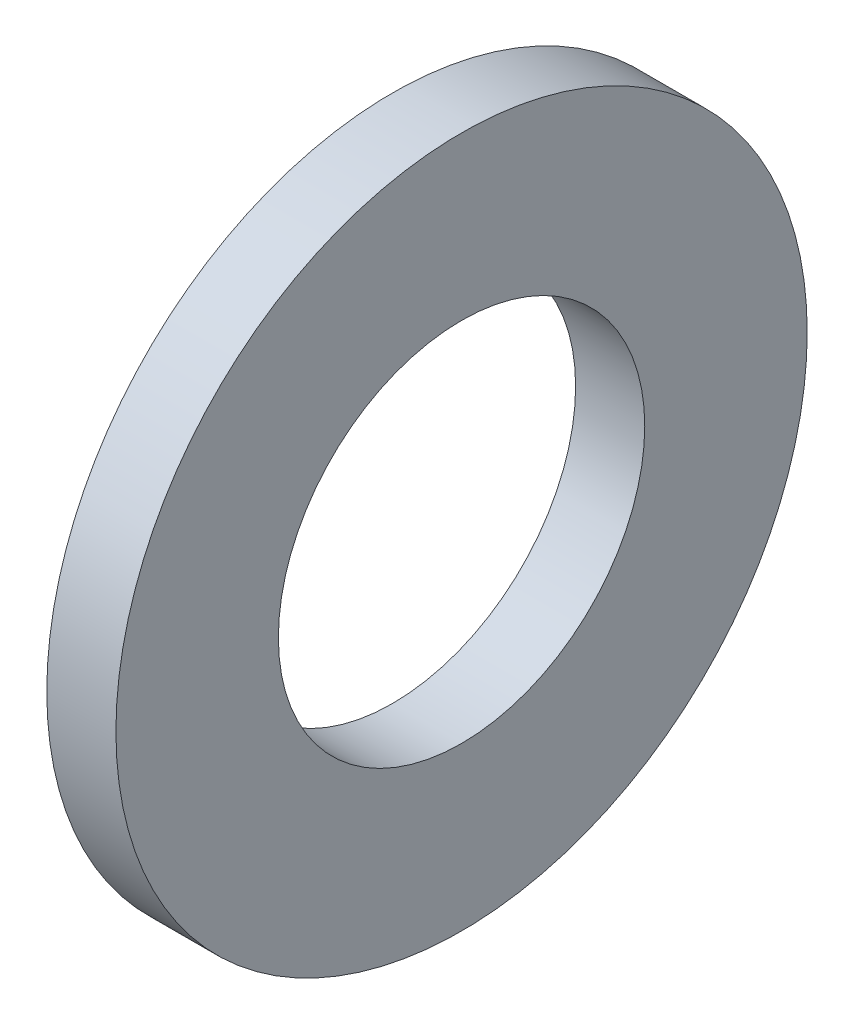
ISO-10303-21;
HEADER;
FILE_DESCRIPTION(('STEP AP214'),'2;1');
FILE_NAME('part.step','',(''),(''),'','','');
FILE_SCHEMA(('AUTOMOTIVE_DESIGN { 1 0 10303 214 1 1 1 1 }'));
ENDSEC;
DATA;
#1=APPLICATION_CONTEXT('core data for automotive mechanical design processes');
#2=APPLICATION_PROTOCOL_DEFINITION('international standard','automotive_design',2000,#1);
#3=PRODUCT_CONTEXT('',#1,'mechanical');
#4=PRODUCT('Part','Part','',(#3));
#5=PRODUCT_RELATED_PRODUCT_CATEGORY('part','',(#4));
#6=PRODUCT_DEFINITION_FORMATION('','',#4);
#7=PRODUCT_DEFINITION_CONTEXT('part definition',#1,'design');
#8=PRODUCT_DEFINITION('design','',#6,#7);
#9=PRODUCT_DEFINITION_SHAPE('','',#8);
#10=(LENGTH_UNIT() NAMED_UNIT(*) SI_UNIT(.MILLI.,.METRE.));
#11=(NAMED_UNIT(*) PLANE_ANGLE_UNIT() SI_UNIT($,.RADIAN.));
#12=(NAMED_UNIT(*) SI_UNIT($,.STERADIAN.) SOLID_ANGLE_UNIT());
#13=UNCERTAINTY_MEASURE_WITH_UNIT(LENGTH_MEASURE(1.E-05),#10,'distance_accuracy_value','');
#14=(GEOMETRIC_REPRESENTATION_CONTEXT(3) GLOBAL_UNCERTAINTY_ASSIGNED_CONTEXT((#13)) GLOBAL_UNIT_ASSIGNED_CONTEXT((#10,
#11,#12)) REPRESENTATION_CONTEXT('',''));
#15=CARTESIAN_POINT('',(0.,0.,0.));
#16=DIRECTION('',(0.,0.,1.));
#17=DIRECTION('',(1.,0.,0.));
#18=AXIS2_PLACEMENT_3D('',#15,#16,#17);
#19=CARTESIAN_POINT('',(-34.9249999999999,0.,0.));
#20=DIRECTION('',(-1.,0.,0.));
#21=DIRECTION('',(0.,0.,1.));
#22=AXIS2_PLACEMENT_3D('',#19,#20,#21);
#23=CYLINDRICAL_SURFACE('',#22,2.65);
#24=CARTESIAN_POINT('',(0.,0.,0.));
#25=DIRECTION('',(-1.,0.,0.));
#26=DIRECTION('',(0.,0.,1.));
#27=AXIS2_PLACEMENT_3D('',#24,#25,#26);
#28=CIRCLE('',#27,2.65);
#29=CARTESIAN_POINT('',(0.,0.,2.65));
#30=VERTEX_POINT('',#29);
#31=EDGE_CURVE('E50',#30,#30,#28,.T.);
#32=ORIENTED_EDGE('',*,*,#31,.F.);
#33=EDGE_LOOP('',(#32));
#34=FACE_BOUND('',#33,.T.);
#35=CARTESIAN_POINT('',(-1.,0.,0.));
#36=DIRECTION('',(-1.,0.,0.));
#37=DIRECTION('',(0.,0.,1.));
#38=AXIS2_PLACEMENT_3D('',#35,#36,#37);
#39=CIRCLE('',#38,2.65);
#40=CARTESIAN_POINT('',(-1.,0.,2.65));
#41=VERTEX_POINT('',#40);
#42=EDGE_CURVE('E10',#41,#41,#39,.T.);
#43=ORIENTED_EDGE('',*,*,#42,.T.);
#44=EDGE_LOOP('',(#43));
#45=FACE_BOUND('',#44,.T.);
#46=ADVANCED_FACE('F36',(#34,#45),#23,.F.);
#47=CARTESIAN_POINT('',(-1.,5.,0.));
#48=DIRECTION('',(1.,0.,0.));
#49=DIRECTION('',(0.,0.,-1.));
#50=AXIS2_PLACEMENT_3D('',#47,#48,#49);
#51=PLANE('',#50);
#52=ORIENTED_EDGE('',*,*,#42,.F.);
#53=EDGE_LOOP('',(#52));
#54=FACE_BOUND('',#53,.T.);
#55=CARTESIAN_POINT('',(-1.,0.,0.));
#56=DIRECTION('',(-1.,0.,0.));
#57=DIRECTION('',(0.,0.,1.));
#58=AXIS2_PLACEMENT_3D('',#55,#56,#57);
#59=CIRCLE('',#58,5.);
#60=CARTESIAN_POINT('',(-1.,0.,5.));
#61=VERTEX_POINT('',#60);
#62=EDGE_CURVE('E42',#61,#61,#59,.T.);
#63=ORIENTED_EDGE('',*,*,#62,.T.);
#64=EDGE_LOOP('',(#63));
#65=FACE_BOUND('',#64,.T.);
#66=ADVANCED_FACE('F59',(#54,#65),#51,.F.);
#67=CARTESIAN_POINT('',(-34.9249999999999,0.,0.));
#68=DIRECTION('',(-1.,0.,0.));
#69=DIRECTION('',(0.,0.,1.));
#70=AXIS2_PLACEMENT_3D('',#67,#68,#69);
#71=CYLINDRICAL_SURFACE('',#70,5.);
#72=ORIENTED_EDGE('',*,*,#62,.F.);
#73=EDGE_LOOP('',(#72));
#74=FACE_BOUND('',#73,.T.);
#75=CARTESIAN_POINT('',(0.,0.,0.));
#76=DIRECTION('',(-1.,0.,0.));
#77=DIRECTION('',(0.,0.,1.));
#78=AXIS2_PLACEMENT_3D('',#75,#76,#77);
#79=CIRCLE('',#78,5.);
#80=CARTESIAN_POINT('',(0.,0.,5.));
#81=VERTEX_POINT('',#80);
#82=EDGE_CURVE('E46',#81,#81,#79,.T.);
#83=ORIENTED_EDGE('',*,*,#82,.T.);
#84=EDGE_LOOP('',(#83));
#85=FACE_BOUND('',#84,.T.);
#86=ADVANCED_FACE('F63',(#74,#85),#71,.T.);
#87=CARTESIAN_POINT('',(0.,2.65,0.));
#88=DIRECTION('',(-1.,0.,0.));
#89=DIRECTION('',(0.,0.,1.));
#90=AXIS2_PLACEMENT_3D('',#87,#88,#89);
#91=PLANE('',#90);
#92=ORIENTED_EDGE('',*,*,#82,.F.);
#93=EDGE_LOOP('',(#92));
#94=FACE_BOUND('',#93,.T.);
#95=ORIENTED_EDGE('',*,*,#31,.T.);
#96=EDGE_LOOP('',(#95));
#97=FACE_BOUND('',#96,.T.);
#98=ADVANCED_FACE('F56',(#94,#97),#91,.F.);
#99=CLOSED_SHELL('',(#46,#66,#86,#98));
#100=MANIFOLD_SOLID_BREP('B2',#99);
#101=ADVANCED_BREP_SHAPE_REPRESENTATION('',(#18,#100),#14);
#102=SHAPE_DEFINITION_REPRESENTATION(#9,#101);
ENDSEC;
END-ISO-10303-21;
